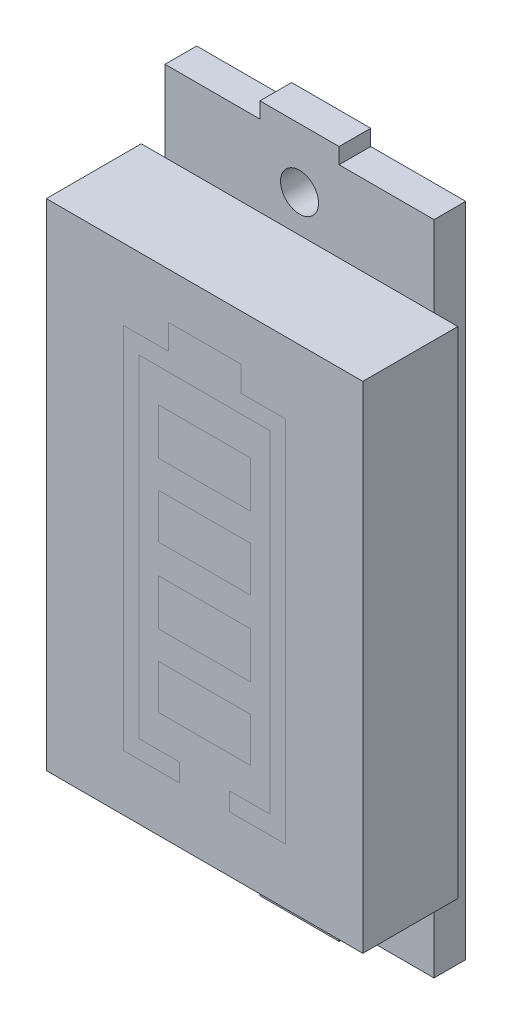
ISO-10303-21;
HEADER;
FILE_DESCRIPTION(('STEP AP214'),'2;1');
FILE_NAME('part.step','',(''),(''),'','','');
FILE_SCHEMA(('AUTOMOTIVE_DESIGN { 1 0 10303 214 1 1 1 1 }'));
ENDSEC;
DATA;
#1=APPLICATION_CONTEXT('core data for automotive mechanical design processes');
#2=APPLICATION_PROTOCOL_DEFINITION('international standard','automotive_design',2000,#1);
#3=PRODUCT_CONTEXT('',#1,'mechanical');
#4=PRODUCT('Part','Part','',(#3));
#5=PRODUCT_RELATED_PRODUCT_CATEGORY('part','',(#4));
#6=PRODUCT_DEFINITION_FORMATION('','',#4);
#7=PRODUCT_DEFINITION_CONTEXT('part definition',#1,'design');
#8=PRODUCT_DEFINITION('design','',#6,#7);
#9=PRODUCT_DEFINITION_SHAPE('','',#8);
#10=(LENGTH_UNIT() NAMED_UNIT(*) SI_UNIT(.MILLI.,.METRE.));
#11=(NAMED_UNIT(*) PLANE_ANGLE_UNIT() SI_UNIT($,.RADIAN.));
#12=(NAMED_UNIT(*) SI_UNIT($,.STERADIAN.) SOLID_ANGLE_UNIT());
#13=UNCERTAINTY_MEASURE_WITH_UNIT(LENGTH_MEASURE(1.E-05),#10,'distance_accuracy_value','');
#14=(GEOMETRIC_REPRESENTATION_CONTEXT(3) GLOBAL_UNCERTAINTY_ASSIGNED_CONTEXT((#13)) GLOBAL_UNIT_ASSIGNED_CONTEXT((#10,
#11,#12)) REPRESENTATION_CONTEXT('',''));
#15=CARTESIAN_POINT('',(0.,0.,0.));
#16=DIRECTION('',(0.,0.,1.));
#17=DIRECTION('',(1.,0.,0.));
#18=AXIS2_PLACEMENT_3D('',#15,#16,#17);
#19=CARTESIAN_POINT('',(0.,0.,6.));
#20=DIRECTION('',(0.,0.,-1.));
#21=DIRECTION('',(-1.,0.,0.));
#22=AXIS2_PLACEMENT_3D('',#19,#20,#21);
#23=PLANE('',#22);
#24=DIRECTION('',(0.,-1.,0.));
#25=VECTOR('',#24,1.);
#26=CARTESIAN_POINT('',(-2.9107326173968,0.,6.));
#27=LINE('',#26,#25);
#28=CARTESIAN_POINT('',(-2.9107326173968,3.2342308849601,6.));
#29=VERTEX_POINT('',#28);
#30=CARTESIAN_POINT('',(-2.9107326173968,0.401295867855901,6.));
#31=VERTEX_POINT('',#30);
#32=EDGE_CURVE('E475',#29,#31,#27,.T.);
#33=ORIENTED_EDGE('',*,*,#32,.F.);
#34=DIRECTION('',(-1.,0.,0.));
#35=VECTOR('',#34,1.);
#36=CARTESIAN_POINT('',(0.,3.2342308849601,6.));
#37=LINE('',#36,#35);
#38=CARTESIAN_POINT('',(2.9107326173968,3.2342308849601,6.));
#39=VERTEX_POINT('',#38);
#40=EDGE_CURVE('E465',#39,#29,#37,.T.);
#41=ORIENTED_EDGE('',*,*,#40,.F.);
#42=DIRECTION('',(0.,1.,0.));
#43=VECTOR('',#42,1.);
#44=CARTESIAN_POINT('',(2.9107326173968,0.,6.));
#45=LINE('',#44,#43);
#46=CARTESIAN_POINT('',(2.9107326173968,0.401295867855901,6.));
#47=VERTEX_POINT('',#46);
#48=EDGE_CURVE('E469',#47,#39,#45,.T.);
#49=ORIENTED_EDGE('',*,*,#48,.F.);
#50=DIRECTION('',(1.,0.,0.));
#51=VECTOR('',#50,1.);
#52=CARTESIAN_POINT('',(0.,0.401295867855901,6.));
#53=LINE('',#52,#51);
#54=EDGE_CURVE('E472',#31,#47,#53,.T.);
#55=ORIENTED_EDGE('',*,*,#54,.F.);
#56=EDGE_LOOP('',(#33,#41,#49,#55));
#57=FACE_BOUND('',#56,.T.);
#58=DIRECTION('',(0.,-1.,0.));
#59=VECTOR('',#58,1.);
#60=CARTESIAN_POINT('',(-2.9107326173968,0.,6.));
#61=LINE('',#60,#59);
#62=CARTESIAN_POINT('',(-2.9107326173968,-6.12532322244118,6.));
#63=VERTEX_POINT('',#62);
#64=CARTESIAN_POINT('',(-2.9107326173968,-8.92129561941144,6.));
#65=VERTEX_POINT('',#64);
#66=EDGE_CURVE('E449',#63,#65,#61,.T.);
#67=ORIENTED_EDGE('',*,*,#66,.F.);
#68=DIRECTION('',(-1.,0.,0.));
#69=VECTOR('',#68,1.);
#70=CARTESIAN_POINT('',(0.,-6.12532322244118,6.));
#71=LINE('',#70,#69);
#72=CARTESIAN_POINT('',(2.9107326173968,-6.12532322244118,6.));
#73=VERTEX_POINT('',#72);
#74=EDGE_CURVE('E439',#73,#63,#71,.T.);
#75=ORIENTED_EDGE('',*,*,#74,.F.);
#76=DIRECTION('',(0.,1.,0.));
#77=VECTOR('',#76,1.);
#78=CARTESIAN_POINT('',(2.9107326173968,0.,6.));
#79=LINE('',#78,#77);
#80=CARTESIAN_POINT('',(2.9107326173968,-8.92129561941144,6.));
#81=VERTEX_POINT('',#80);
#82=EDGE_CURVE('E443',#81,#73,#79,.T.);
#83=ORIENTED_EDGE('',*,*,#82,.F.);
#84=DIRECTION('',(1.,0.,0.));
#85=VECTOR('',#84,1.);
#86=CARTESIAN_POINT('',(0.,-8.92129561941144,6.));
#87=LINE('',#86,#85);
#88=EDGE_CURVE('E446',#65,#81,#87,.T.);
#89=ORIENTED_EDGE('',*,*,#88,.F.);
#90=EDGE_LOOP('',(#67,#75,#83,#89));
#91=FACE_BOUND('',#90,.T.);
#92=DIRECTION('',(0.,1.,0.));
#93=VECTOR('',#92,1.);
#94=CARTESIAN_POINT('',(10.,-15.65,6.));
#95=LINE('',#94,#93);
#96=CARTESIAN_POINT('',(10.,-15.65,6.));
#97=VERTEX_POINT('',#96);
#98=CARTESIAN_POINT('',(10.,15.65,6.));
#99=VERTEX_POINT('',#98);
#100=EDGE_CURVE('E355',#97,#99,#95,.T.);
#101=ORIENTED_EDGE('',*,*,#100,.T.);
#102=DIRECTION('',(-1.,0.,0.));
#103=VECTOR('',#102,1.);
#104=CARTESIAN_POINT('',(-10.,15.65,6.));
#105=LINE('',#104,#103);
#106=CARTESIAN_POINT('',(-10.,15.65,6.));
#107=VERTEX_POINT('',#106);
#108=EDGE_CURVE('E358',#99,#107,#105,.T.);
#109=ORIENTED_EDGE('',*,*,#108,.T.);
#110=DIRECTION('',(0.,-1.,0.));
#111=VECTOR('',#110,1.);
#112=CARTESIAN_POINT('',(-10.,-15.65,6.));
#113=LINE('',#112,#111);
#114=CARTESIAN_POINT('',(-10.,-15.65,6.));
#115=VERTEX_POINT('',#114);
#116=EDGE_CURVE('E361',#107,#115,#113,.T.);
#117=ORIENTED_EDGE('',*,*,#116,.T.);
#118=DIRECTION('',(1.,0.,0.));
#119=VECTOR('',#118,1.);
#120=CARTESIAN_POINT('',(-10.,-15.65,6.));
#121=LINE('',#120,#119);
#122=EDGE_CURVE('E363',#115,#97,#121,.T.);
#123=ORIENTED_EDGE('',*,*,#122,.T.);
#124=EDGE_LOOP('',(#101,#109,#117,#123));
#125=FACE_BOUND('',#124,.T.);
#126=DIRECTION('',(0.,1.,0.));
#127=VECTOR('',#126,1.);
#128=CARTESIAN_POINT('',(-1.58768687317069,0.,6.));
#129=LINE('',#128,#127);
#130=CARTESIAN_POINT('',(-1.58768687317069,-12.1184032650436,6.));
#131=VERTEX_POINT('',#130);
#132=CARTESIAN_POINT('',(-1.58768687317069,-10.972614646314,6.));
#133=VERTEX_POINT('',#132);
#134=EDGE_CURVE('E436',#131,#133,#129,.T.);
#135=ORIENTED_EDGE('',*,*,#134,.F.);
#136=DIRECTION('',(1.,0.,0.));
#137=VECTOR('',#136,1.);
#138=CARTESIAN_POINT('',(0.,-12.1184032650436,6.));
#139=LINE('',#138,#137);
#140=CARTESIAN_POINT('',(-5.11900421161258,-12.1184032650436,6.));
#141=VERTEX_POINT('',#140);
#142=EDGE_CURVE('E390',#141,#131,#139,.T.);
#143=ORIENTED_EDGE('',*,*,#142,.F.);
#144=DIRECTION('',(0.,-1.,0.));
#145=VECTOR('',#144,1.);
#146=CARTESIAN_POINT('',(-5.11900421161258,0.,6.));
#147=LINE('',#146,#145);
#148=CARTESIAN_POINT('',(-5.11900421161258,11.1491322110625,6.));
#149=VERTEX_POINT('',#148);
#150=EDGE_CURVE('E394',#149,#141,#147,.T.);
#151=ORIENTED_EDGE('',*,*,#150,.F.);
#152=DIRECTION('',(-1.,0.,0.));
#153=VECTOR('',#152,1.);
#154=CARTESIAN_POINT('',(0.,11.1491322110625,6.));
#155=LINE('',#154,#153);
#156=CARTESIAN_POINT('',(-2.29362193475144,11.1491322110625,6.));
#157=VERTEX_POINT('',#156);
#158=EDGE_CURVE('E397',#157,#149,#155,.T.);
#159=ORIENTED_EDGE('',*,*,#158,.F.);
#160=DIRECTION('',(0.,-1.,0.));
#161=VECTOR('',#160,1.);
#162=CARTESIAN_POINT('',(-2.29362193475144,0.,6.));
#163=LINE('',#162,#161);
#164=CARTESIAN_POINT('',(-2.29362193475144,12.7390471305929,6.));
#165=VERTEX_POINT('',#164);
#166=EDGE_CURVE('E400',#165,#157,#163,.T.);
#167=ORIENTED_EDGE('',*,*,#166,.F.);
#168=DIRECTION('',(-1.,0.,0.));
#169=VECTOR('',#168,1.);
#170=CARTESIAN_POINT('',(0.,12.7390471305929,6.));
#171=LINE('',#170,#169);
#172=CARTESIAN_POINT('',(2.29362193475143,12.7390471305929,6.));
#173=VERTEX_POINT('',#172);
#174=EDGE_CURVE('E403',#173,#165,#171,.T.);
#175=ORIENTED_EDGE('',*,*,#174,.F.);
#176=DIRECTION('',(0.,1.,0.));
#177=VECTOR('',#176,1.);
#178=CARTESIAN_POINT('',(2.29362193475143,0.,6.));
#179=LINE('',#178,#177);
#180=CARTESIAN_POINT('',(2.29362193475143,11.1491322110625,6.));
#181=VERTEX_POINT('',#180);
#182=EDGE_CURVE('E406',#181,#173,#179,.T.);
#183=ORIENTED_EDGE('',*,*,#182,.F.);
#184=DIRECTION('',(-1.,0.,0.));
#185=VECTOR('',#184,1.);
#186=CARTESIAN_POINT('',(0.,11.1491322110625,6.));
#187=LINE('',#186,#185);
#188=CARTESIAN_POINT('',(5.11900421161257,11.1491322110625,6.));
#189=VERTEX_POINT('',#188);
#190=EDGE_CURVE('E409',#189,#181,#187,.T.);
#191=ORIENTED_EDGE('',*,*,#190,.F.);
#192=DIRECTION('',(0.,1.,0.));
#193=VECTOR('',#192,1.);
#194=CARTESIAN_POINT('',(5.11900421161257,0.,6.));
#195=LINE('',#194,#193);
#196=CARTESIAN_POINT('',(5.11900421161257,-12.1184032650436,6.));
#197=VERTEX_POINT('',#196);
#198=EDGE_CURVE('E412',#197,#189,#195,.T.);
#199=ORIENTED_EDGE('',*,*,#198,.F.);
#200=DIRECTION('',(1.,0.,0.));
#201=VECTOR('',#200,1.);
#202=CARTESIAN_POINT('',(0.,-12.1184032650436,6.));
#203=LINE('',#202,#201);
#204=CARTESIAN_POINT('',(1.58768687317069,-12.1184032650436,6.));
#205=VERTEX_POINT('',#204);
#206=EDGE_CURVE('E415',#205,#197,#203,.T.);
#207=ORIENTED_EDGE('',*,*,#206,.F.);
#208=DIRECTION('',(0.,-1.,0.));
#209=VECTOR('',#208,1.);
#210=CARTESIAN_POINT('',(1.58768687317069,0.,6.));
#211=LINE('',#210,#209);
#212=CARTESIAN_POINT('',(1.58768687317069,-10.972614646314,6.));
#213=VERTEX_POINT('',#212);
#214=EDGE_CURVE('E418',#213,#205,#211,.T.);
#215=ORIENTED_EDGE('',*,*,#214,.F.);
#216=DIRECTION('',(-1.,0.,0.));
#217=VECTOR('',#216,1.);
#218=CARTESIAN_POINT('',(0.,-10.972614646314,6.));
#219=LINE('',#218,#217);
#220=CARTESIAN_POINT('',(4.12847373491433,-10.972614646314,6.));
#221=VERTEX_POINT('',#220);
#222=EDGE_CURVE('E421',#221,#213,#219,.T.);
#223=ORIENTED_EDGE('',*,*,#222,.F.);
#224=DIRECTION('',(0.,-1.,0.));
#225=VECTOR('',#224,1.);
#226=CARTESIAN_POINT('',(4.12847373491433,0.,6.));
#227=LINE('',#226,#225);
#228=CARTESIAN_POINT('',(4.12847373491433,10.0169154362936,6.));
#229=VERTEX_POINT('',#228);
#230=EDGE_CURVE('E424',#229,#221,#227,.T.);
#231=ORIENTED_EDGE('',*,*,#230,.F.);
#232=DIRECTION('',(1.,0.,0.));
#233=VECTOR('',#232,1.);
#234=CARTESIAN_POINT('',(0.,10.0169154362936,6.));
#235=LINE('',#234,#233);
#236=CARTESIAN_POINT('',(-4.12847373491433,10.0169154362936,6.));
#237=VERTEX_POINT('',#236);
#238=EDGE_CURVE('E427',#237,#229,#235,.T.);
#239=ORIENTED_EDGE('',*,*,#238,.F.);
#240=DIRECTION('',(0.,1.,0.));
#241=VECTOR('',#240,1.);
#242=CARTESIAN_POINT('',(-4.12847373491433,0.,6.));
#243=LINE('',#242,#241);
#244=CARTESIAN_POINT('',(-4.12847373491433,-10.972614646314,6.));
#245=VERTEX_POINT('',#244);
#246=EDGE_CURVE('E430',#245,#237,#243,.T.);
#247=ORIENTED_EDGE('',*,*,#246,.F.);
#248=DIRECTION('',(-1.,0.,0.));
#249=VECTOR('',#248,1.);
#250=CARTESIAN_POINT('',(0.,-10.972614646314,6.));
#251=LINE('',#250,#249);
#252=EDGE_CURVE('E433',#133,#245,#251,.T.);
#253=ORIENTED_EDGE('',*,*,#252,.F.);
#254=EDGE_LOOP('',(#135,#143,#151,#159,#167,#175,#183,#191,#199,#207,#215,#223,#231,#239,#247,#253));
#255=FACE_BOUND('',#254,.T.);
#256=DIRECTION('',(0.,-1.,0.));
#257=VECTOR('',#256,1.);
#258=CARTESIAN_POINT('',(-2.9107326173968,0.,6.));
#259=LINE('',#258,#257);
#260=CARTESIAN_POINT('',(-2.9107326173968,-1.44093348775742,6.));
#261=VERTEX_POINT('',#260);
#262=CARTESIAN_POINT('',(-2.9107326173968,-4.35016215370794,6.));
#263=VERTEX_POINT('',#262);
#264=EDGE_CURVE('E462',#261,#263,#259,.T.);
#265=ORIENTED_EDGE('',*,*,#264,.F.);
#266=DIRECTION('',(-1.,0.,0.));
#267=VECTOR('',#266,1.);
#268=CARTESIAN_POINT('',(0.,-1.44093348775742,6.));
#269=LINE('',#268,#267);
#270=CARTESIAN_POINT('',(2.9107326173968,-1.44093348775742,6.));
#271=VERTEX_POINT('',#270);
#272=EDGE_CURVE('E452',#271,#261,#269,.T.);
#273=ORIENTED_EDGE('',*,*,#272,.F.);
#274=DIRECTION('',(0.,1.,0.));
#275=VECTOR('',#274,1.);
#276=CARTESIAN_POINT('',(2.9107326173968,0.,6.));
#277=LINE('',#276,#275);
#278=CARTESIAN_POINT('',(2.9107326173968,-4.35016215370794,6.));
#279=VERTEX_POINT('',#278);
#280=EDGE_CURVE('E456',#279,#271,#277,.T.);
#281=ORIENTED_EDGE('',*,*,#280,.F.);
#282=DIRECTION('',(1.,0.,0.));
#283=VECTOR('',#282,1.);
#284=CARTESIAN_POINT('',(0.,-4.35016215370794,6.));
#285=LINE('',#284,#283);
#286=EDGE_CURVE('E459',#263,#279,#285,.T.);
#287=ORIENTED_EDGE('',*,*,#286,.F.);
#288=EDGE_LOOP('',(#265,#273,#281,#287));
#289=FACE_BOUND('',#288,.T.);
#290=DIRECTION('',(0.,-1.,0.));
#291=VECTOR('',#290,1.);
#292=CARTESIAN_POINT('',(-2.9107326173968,0.,6.));
#293=LINE('',#292,#291);
#294=CARTESIAN_POINT('',(-2.9107326173968,7.90670349185868,6.));
#295=VERTEX_POINT('',#294);
#296=CARTESIAN_POINT('',(-2.9107326173968,4.99048017288609,6.));
#297=VERTEX_POINT('',#296);
#298=EDGE_CURVE('E11',#295,#297,#293,.T.);
#299=ORIENTED_EDGE('',*,*,#298,.F.);
#300=DIRECTION('',(-1.,0.,0.));
#301=VECTOR('',#300,1.);
#302=CARTESIAN_POINT('',(0.,7.90670349185868,6.));
#303=LINE('',#302,#301);
#304=CARTESIAN_POINT('',(2.9107326173968,7.90670349185868,6.));
#305=VERTEX_POINT('',#304);
#306=EDGE_CURVE('E478',#305,#295,#303,.T.);
#307=ORIENTED_EDGE('',*,*,#306,.F.);
#308=DIRECTION('',(0.,1.,0.));
#309=VECTOR('',#308,1.);
#310=CARTESIAN_POINT('',(2.9107326173968,0.,6.));
#311=LINE('',#310,#309);
#312=CARTESIAN_POINT('',(2.9107326173968,4.99048017288609,6.));
#313=VERTEX_POINT('',#312);
#314=EDGE_CURVE('E481',#313,#305,#311,.T.);
#315=ORIENTED_EDGE('',*,*,#314,.F.);
#316=DIRECTION('',(1.,0.,0.));
#317=VECTOR('',#316,1.);
#318=CARTESIAN_POINT('',(0.,4.99048017288609,6.));
#319=LINE('',#318,#317);
#320=EDGE_CURVE('E45',#297,#313,#319,.T.);
#321=ORIENTED_EDGE('',*,*,#320,.F.);
#322=EDGE_LOOP('',(#299,#307,#315,#321));
#323=FACE_BOUND('',#322,.T.);
#324=ADVANCED_FACE('F36',(#57,#91,#125,#255,#289,#323),#23,.F.);
#325=ORIENTED_EDGE('',*,*,#306,.T.);
#326=ORIENTED_EDGE('',*,*,#298,.T.);
#327=ORIENTED_EDGE('',*,*,#320,.T.);
#328=ORIENTED_EDGE('',*,*,#314,.T.);
#329=EDGE_LOOP('',(#325,#326,#327,#328));
#330=FACE_BOUND('',#329,.T.);
#331=ADVANCED_FACE('F549',(#330),#23,.F.);
#332=ORIENTED_EDGE('',*,*,#40,.T.);
#333=ORIENTED_EDGE('',*,*,#32,.T.);
#334=ORIENTED_EDGE('',*,*,#54,.T.);
#335=ORIENTED_EDGE('',*,*,#48,.T.);
#336=EDGE_LOOP('',(#332,#333,#334,#335));
#337=FACE_BOUND('',#336,.T.);
#338=ADVANCED_FACE('F558',(#337),#23,.F.);
#339=ORIENTED_EDGE('',*,*,#272,.T.);
#340=ORIENTED_EDGE('',*,*,#264,.T.);
#341=ORIENTED_EDGE('',*,*,#286,.T.);
#342=ORIENTED_EDGE('',*,*,#280,.T.);
#343=EDGE_LOOP('',(#339,#340,#341,#342));
#344=FACE_BOUND('',#343,.T.);
#345=ADVANCED_FACE('F579',(#344),#23,.F.);
#346=ORIENTED_EDGE('',*,*,#74,.T.);
#347=ORIENTED_EDGE('',*,*,#66,.T.);
#348=ORIENTED_EDGE('',*,*,#88,.T.);
#349=ORIENTED_EDGE('',*,*,#82,.T.);
#350=EDGE_LOOP('',(#346,#347,#348,#349));
#351=FACE_BOUND('',#350,.T.);
#352=ADVANCED_FACE('F566',(#351),#23,.F.);
#353=CARTESIAN_POINT('',(0.,0.,-2.));
#354=DIRECTION('',(0.,0.,1.));
#355=DIRECTION('',(1.,0.,0.));
#356=AXIS2_PLACEMENT_3D('',#353,#354,#355);
#357=PLANE('',#356);
#358=CARTESIAN_POINT('',(0.,-18.,-2.));
#359=DIRECTION('',(0.,0.,-1.));
#360=DIRECTION('',(-1.,0.,0.));
#361=AXIS2_PLACEMENT_3D('',#358,#359,#360);
#362=CIRCLE('',#361,1.2);
#363=CARTESIAN_POINT('',(-1.2,-18.,-2.));
#364=VERTEX_POINT('',#363);
#365=EDGE_CURVE('E704',#364,#364,#362,.T.);
#366=ORIENTED_EDGE('',*,*,#365,.F.);
#367=EDGE_LOOP('',(#366));
#368=FACE_BOUND('',#367,.T.);
#369=DIRECTION('',(-1.,0.,0.));
#370=VECTOR('',#369,1.);
#371=CARTESIAN_POINT('',(8.5,-20.75,-2.));
#372=LINE('',#371,#370);
#373=CARTESIAN_POINT('',(8.5,-20.75,-2.));
#374=VERTEX_POINT('',#373);
#375=CARTESIAN_POINT('',(2.5,-20.75,-2.));
#376=VERTEX_POINT('',#375);
#377=EDGE_CURVE('E324',#374,#376,#372,.T.);
#378=ORIENTED_EDGE('',*,*,#377,.T.);
#379=DIRECTION('',(0.,-1.,0.));
#380=VECTOR('',#379,1.);
#381=CARTESIAN_POINT('',(2.5,-21.75,-2.));
#382=LINE('',#381,#380);
#383=CARTESIAN_POINT('',(2.5,-21.75,-2.));
#384=VERTEX_POINT('',#383);
#385=EDGE_CURVE('E291',#376,#384,#382,.T.);
#386=ORIENTED_EDGE('',*,*,#385,.T.);
#387=DIRECTION('',(-1.,0.,0.));
#388=VECTOR('',#387,1.);
#389=CARTESIAN_POINT('',(2.5,-21.75,-2.));
#390=LINE('',#389,#388);
#391=CARTESIAN_POINT('',(-2.5,-21.75,-2.));
#392=VERTEX_POINT('',#391);
#393=EDGE_CURVE('E265',#384,#392,#390,.T.);
#394=ORIENTED_EDGE('',*,*,#393,.T.);
#395=DIRECTION('',(0.,1.,0.));
#396=VECTOR('',#395,1.);
#397=CARTESIAN_POINT('',(-2.5,-21.75,-2.));
#398=LINE('',#397,#396);
#399=CARTESIAN_POINT('',(-2.5,-20.75,-2.));
#400=VERTEX_POINT('',#399);
#401=EDGE_CURVE('E287',#392,#400,#398,.T.);
#402=ORIENTED_EDGE('',*,*,#401,.T.);
#403=CARTESIAN_POINT('',(-8.5,-20.75,-2.));
#404=VERTEX_POINT('',#403);
#405=EDGE_CURVE('E323',#400,#404,#372,.T.);
#406=ORIENTED_EDGE('',*,*,#405,.T.);
#407=DIRECTION('',(0.,1.,0.));
#408=VECTOR('',#407,1.);
#409=CARTESIAN_POINT('',(-8.5,-20.75,-2.));
#410=LINE('',#409,#408);
#411=CARTESIAN_POINT('',(-8.5,20.75,-2.));
#412=VERTEX_POINT('',#411);
#413=EDGE_CURVE('E313',#404,#412,#410,.T.);
#414=ORIENTED_EDGE('',*,*,#413,.T.);
#415=DIRECTION('',(1.,0.,0.));
#416=VECTOR('',#415,1.);
#417=CARTESIAN_POINT('',(8.5,20.75,-2.));
#418=LINE('',#417,#416);
#419=CARTESIAN_POINT('',(-2.5,20.75,-2.));
#420=VERTEX_POINT('',#419);
#421=EDGE_CURVE('E318',#412,#420,#418,.T.);
#422=ORIENTED_EDGE('',*,*,#421,.T.);
#423=CARTESIAN_POINT('',(-2.5,21.75,-2.));
#424=VERTEX_POINT('',#423);
#425=EDGE_CURVE('E289',#420,#424,#398,.T.);
#426=ORIENTED_EDGE('',*,*,#425,.T.);
#427=DIRECTION('',(1.,0.,0.));
#428=VECTOR('',#427,1.);
#429=CARTESIAN_POINT('',(2.5,21.75,-2.));
#430=LINE('',#429,#428);
#431=CARTESIAN_POINT('',(2.5,21.75,-2.));
#432=VERTEX_POINT('',#431);
#433=EDGE_CURVE('E272',#424,#432,#430,.T.);
#434=ORIENTED_EDGE('',*,*,#433,.T.);
#435=CARTESIAN_POINT('',(2.5,20.75,-2.));
#436=VERTEX_POINT('',#435);
#437=EDGE_CURVE('E292',#432,#436,#382,.T.);
#438=ORIENTED_EDGE('',*,*,#437,.T.);
#439=CARTESIAN_POINT('',(8.5,20.75,-2.));
#440=VERTEX_POINT('',#439);
#441=EDGE_CURVE('E316',#436,#440,#418,.T.);
#442=ORIENTED_EDGE('',*,*,#441,.T.);
#443=DIRECTION('',(0.,-1.,0.));
#444=VECTOR('',#443,1.);
#445=CARTESIAN_POINT('',(8.5,-20.75,-2.));
#446=LINE('',#445,#444);
#447=EDGE_CURVE('E321',#440,#374,#446,.T.);
#448=ORIENTED_EDGE('',*,*,#447,.T.);
#449=EDGE_LOOP('',(#378,#386,#394,#402,#406,#414,#422,#426,#434,#438,#442,#448));
#450=FACE_BOUND('',#449,.T.);
#451=CARTESIAN_POINT('',(0.,18.,-2.));
#452=DIRECTION('',(0.,0.,-1.));
#453=DIRECTION('',(-1.,0.,0.));
#454=AXIS2_PLACEMENT_3D('',#451,#452,#453);
#455=CIRCLE('',#454,1.2);
#456=CARTESIAN_POINT('',(-1.19999999999999,18.,-2.));
#457=VERTEX_POINT('',#456);
#458=EDGE_CURVE('E705',#457,#457,#455,.T.);
#459=ORIENTED_EDGE('',*,*,#458,.F.);
#460=EDGE_LOOP('',(#459));
#461=FACE_BOUND('',#460,.T.);
#462=ADVANCED_FACE('F578',(#368,#450,#461),#357,.F.);
#463=CARTESIAN_POINT('',(8.5,20.75,-2.));
#464=DIRECTION('',(0.,-1.,0.));
#465=DIRECTION('',(0.,0.,-1.));
#466=AXIS2_PLACEMENT_3D('',#463,#464,#465);
#467=PLANE('',#466);
#468=DIRECTION('',(1.,0.,0.));
#469=VECTOR('',#468,1.);
#470=CARTESIAN_POINT('',(8.5,20.75,0.));
#471=LINE('',#470,#469);
#472=CARTESIAN_POINT('',(-8.5,20.75,0.));
#473=VERTEX_POINT('',#472);
#474=CARTESIAN_POINT('',(-2.5,20.75,0.));
#475=VERTEX_POINT('',#474);
#476=EDGE_CURVE('E333',#473,#475,#471,.T.);
#477=ORIENTED_EDGE('',*,*,#476,.T.);
#478=DIRECTION('',(0.,0.,-1.));
#479=VECTOR('',#478,1.);
#480=CARTESIAN_POINT('',(-2.5,20.75,-2.));
#481=LINE('',#480,#479);
#482=EDGE_CURVE('E259',#475,#420,#481,.T.);
#483=ORIENTED_EDGE('',*,*,#482,.T.);
#484=ORIENTED_EDGE('',*,*,#421,.F.);
#485=DIRECTION('',(0.,0.,1.));
#486=VECTOR('',#485,1.);
#487=CARTESIAN_POINT('',(-8.5,20.75,-2.));
#488=LINE('',#487,#486);
#489=EDGE_CURVE('E351',#412,#473,#488,.T.);
#490=ORIENTED_EDGE('',*,*,#489,.T.);
#491=EDGE_LOOP('',(#477,#483,#484,#490));
#492=FACE_BOUND('',#491,.T.);
#493=ADVANCED_FACE('F585',(#492),#467,.F.);
#494=CARTESIAN_POINT('',(8.5,-20.75,-2.));
#495=DIRECTION('',(0.,1.,0.));
#496=DIRECTION('',(0.,0.,1.));
#497=AXIS2_PLACEMENT_3D('',#494,#495,#496);
#498=PLANE('',#497);
#499=ORIENTED_EDGE('',*,*,#405,.F.);
#500=DIRECTION('',(0.,0.,1.));
#501=VECTOR('',#500,1.);
#502=CARTESIAN_POINT('',(-2.5,-20.75,-2.));
#503=LINE('',#502,#501);
#504=CARTESIAN_POINT('',(-2.5,-20.75,0.));
#505=VERTEX_POINT('',#504);
#506=EDGE_CURVE('E308',#400,#505,#503,.T.);
#507=ORIENTED_EDGE('',*,*,#506,.T.);
#508=DIRECTION('',(-1.,0.,0.));
#509=VECTOR('',#508,1.);
#510=CARTESIAN_POINT('',(8.5,-20.75,0.));
#511=LINE('',#510,#509);
#512=CARTESIAN_POINT('',(-8.5,-20.75,0.));
#513=VERTEX_POINT('',#512);
#514=EDGE_CURVE('E339',#505,#513,#511,.T.);
#515=ORIENTED_EDGE('',*,*,#514,.T.);
#516=DIRECTION('',(0.,0.,1.));
#517=VECTOR('',#516,1.);
#518=CARTESIAN_POINT('',(-8.5,-20.75,-2.));
#519=LINE('',#518,#517);
#520=EDGE_CURVE('E327',#404,#513,#519,.T.);
#521=ORIENTED_EDGE('',*,*,#520,.F.);
#522=EDGE_LOOP('',(#499,#507,#515,#521));
#523=FACE_BOUND('',#522,.T.);
#524=ADVANCED_FACE('F671',(#523),#498,.F.);
#525=CARTESIAN_POINT('',(0.,0.,0.));
#526=DIRECTION('',(0.,0.,-1.));
#527=DIRECTION('',(-1.,0.,0.));
#528=AXIS2_PLACEMENT_3D('',#525,#526,#527);
#529=PLANE('',#528);
#530=DIRECTION('',(0.,1.,0.));
#531=VECTOR('',#530,1.);
#532=CARTESIAN_POINT('',(-8.5,-20.75,0.));
#533=LINE('',#532,#531);
#534=CARTESIAN_POINT('',(-8.5,-15.65,0.));
#535=VERTEX_POINT('',#534);
#536=CARTESIAN_POINT('',(-8.5,15.65,0.));
#537=VERTEX_POINT('',#536);
#538=EDGE_CURVE('E332',#535,#537,#533,.T.);
#539=ORIENTED_EDGE('',*,*,#538,.F.);
#540=DIRECTION('',(1.,0.,0.));
#541=VECTOR('',#540,1.);
#542=CARTESIAN_POINT('',(-10.,-15.65,0.));
#543=LINE('',#542,#541);
#544=CARTESIAN_POINT('',(-10.,-15.65,0.));
#545=VERTEX_POINT('',#544);
#546=EDGE_CURVE('E359',#545,#535,#543,.T.);
#547=ORIENTED_EDGE('',*,*,#546,.F.);
#548=DIRECTION('',(0.,-1.,0.));
#549=VECTOR('',#548,1.);
#550=CARTESIAN_POINT('',(-10.,-15.65,0.));
#551=LINE('',#550,#549);
#552=CARTESIAN_POINT('',(-10.,15.65,0.));
#553=VERTEX_POINT('',#552);
#554=EDGE_CURVE('E372',#553,#545,#551,.T.);
#555=ORIENTED_EDGE('',*,*,#554,.F.);
#556=DIRECTION('',(-1.,0.,0.));
#557=VECTOR('',#556,1.);
#558=CARTESIAN_POINT('',(-10.,15.65,0.));
#559=LINE('',#558,#557);
#560=EDGE_CURVE('E368',#537,#553,#559,.T.);
#561=ORIENTED_EDGE('',*,*,#560,.F.);
#562=EDGE_LOOP('',(#539,#547,#555,#561));
#563=FACE_BOUND('',#562,.T.);
#564=ADVANCED_FACE('F573',(#563),#529,.T.);
#565=CARTESIAN_POINT('',(10.,-15.65,6.));
#566=DIRECTION('',(-1.,0.,0.));
#567=DIRECTION('',(0.,0.,1.));
#568=AXIS2_PLACEMENT_3D('',#565,#566,#567);
#569=PLANE('',#568);
#570=DIRECTION('',(0.,1.,0.));
#571=VECTOR('',#570,1.);
#572=CARTESIAN_POINT('',(10.,-15.65,0.));
#573=LINE('',#572,#571);
#574=CARTESIAN_POINT('',(10.,-15.65,0.));
#575=VERTEX_POINT('',#574);
#576=CARTESIAN_POINT('',(10.,15.65,0.));
#577=VERTEX_POINT('',#576);
#578=EDGE_CURVE('E354',#575,#577,#573,.T.);
#579=ORIENTED_EDGE('',*,*,#578,.T.);
#580=DIRECTION('',(0.,0.,-1.));
#581=VECTOR('',#580,1.);
#582=CARTESIAN_POINT('',(10.,15.65,6.));
#583=LINE('',#582,#581);
#584=EDGE_CURVE('E387',#99,#577,#583,.T.);
#585=ORIENTED_EDGE('',*,*,#584,.F.);
#586=ORIENTED_EDGE('',*,*,#100,.F.);
#587=DIRECTION('',(0.,0.,-1.));
#588=VECTOR('',#587,1.);
#589=CARTESIAN_POINT('',(10.,-15.65,6.));
#590=LINE('',#589,#588);
#591=EDGE_CURVE('E365',#97,#575,#590,.T.);
#592=ORIENTED_EDGE('',*,*,#591,.T.);
#593=EDGE_LOOP('',(#579,#585,#586,#592));
#594=FACE_BOUND('',#593,.T.);
#595=ADVANCED_FACE('F38',(#594),#569,.F.);
#596=CARTESIAN_POINT('',(-10.,15.65,6.));
#597=DIRECTION('',(0.,-1.,0.));
#598=DIRECTION('',(0.,0.,-1.));
#599=AXIS2_PLACEMENT_3D('',#596,#597,#598);
#600=PLANE('',#599);
#601=CARTESIAN_POINT('',(8.5,15.65,0.));
#602=VERTEX_POINT('',#601);
#603=EDGE_CURVE('E369',#577,#602,#559,.T.);
#604=ORIENTED_EDGE('',*,*,#603,.T.);
#605=EDGE_CURVE('E373',#602,#537,#559,.T.);
#606=ORIENTED_EDGE('',*,*,#605,.T.);
#607=ORIENTED_EDGE('',*,*,#560,.T.);
#608=DIRECTION('',(0.,0.,-1.));
#609=VECTOR('',#608,1.);
#610=CARTESIAN_POINT('',(-10.,15.65,6.));
#611=LINE('',#610,#609);
#612=EDGE_CURVE('E384',#107,#553,#611,.T.);
#613=ORIENTED_EDGE('',*,*,#612,.F.);
#614=ORIENTED_EDGE('',*,*,#108,.F.);
#615=ORIENTED_EDGE('',*,*,#584,.T.);
#616=EDGE_LOOP('',(#604,#606,#607,#613,#614,#615));
#617=FACE_BOUND('',#616,.T.);
#618=ADVANCED_FACE('F621',(#617),#600,.F.);
#619=CARTESIAN_POINT('',(-10.,-15.65,6.));
#620=DIRECTION('',(1.,0.,0.));
#621=DIRECTION('',(0.,0.,-1.));
#622=AXIS2_PLACEMENT_3D('',#619,#620,#621);
#623=PLANE('',#622);
#624=ORIENTED_EDGE('',*,*,#554,.T.);
#625=DIRECTION('',(0.,0.,-1.));
#626=VECTOR('',#625,1.);
#627=CARTESIAN_POINT('',(-10.,-15.65,6.));
#628=LINE('',#627,#626);
#629=EDGE_CURVE('E381',#115,#545,#628,.T.);
#630=ORIENTED_EDGE('',*,*,#629,.F.);
#631=ORIENTED_EDGE('',*,*,#116,.F.);
#632=ORIENTED_EDGE('',*,*,#612,.T.);
#633=EDGE_LOOP('',(#624,#630,#631,#632));
#634=FACE_BOUND('',#633,.T.);
#635=ADVANCED_FACE('F574',(#634),#623,.F.);
#636=CARTESIAN_POINT('',(-10.,-15.65,6.));
#637=DIRECTION('',(0.,1.,0.));
#638=DIRECTION('',(0.,0.,1.));
#639=AXIS2_PLACEMENT_3D('',#636,#637,#638);
#640=PLANE('',#639);
#641=ORIENTED_EDGE('',*,*,#546,.T.);
#642=CARTESIAN_POINT('',(8.5,-15.65,0.));
#643=VERTEX_POINT('',#642);
#644=EDGE_CURVE('E378',#535,#643,#543,.T.);
#645=ORIENTED_EDGE('',*,*,#644,.T.);
#646=EDGE_CURVE('E375',#643,#575,#543,.T.);
#647=ORIENTED_EDGE('',*,*,#646,.T.);
#648=ORIENTED_EDGE('',*,*,#591,.F.);
#649=ORIENTED_EDGE('',*,*,#122,.F.);
#650=ORIENTED_EDGE('',*,*,#629,.T.);
#651=EDGE_LOOP('',(#641,#645,#647,#648,#649,#650));
#652=FACE_BOUND('',#651,.T.);
#653=ADVANCED_FACE('F564',(#652),#640,.F.);
#654=ORIENTED_EDGE('',*,*,#142,.T.);
#655=ORIENTED_EDGE('',*,*,#134,.T.);
#656=ORIENTED_EDGE('',*,*,#252,.T.);
#657=ORIENTED_EDGE('',*,*,#246,.T.);
#658=ORIENTED_EDGE('',*,*,#238,.T.);
#659=ORIENTED_EDGE('',*,*,#230,.T.);
#660=ORIENTED_EDGE('',*,*,#222,.T.);
#661=ORIENTED_EDGE('',*,*,#214,.T.);
#662=ORIENTED_EDGE('',*,*,#206,.T.);
#663=ORIENTED_EDGE('',*,*,#198,.T.);
#664=ORIENTED_EDGE('',*,*,#190,.T.);
#665=ORIENTED_EDGE('',*,*,#182,.T.);
#666=ORIENTED_EDGE('',*,*,#174,.T.);
#667=ORIENTED_EDGE('',*,*,#166,.T.);
#668=ORIENTED_EDGE('',*,*,#158,.T.);
#669=ORIENTED_EDGE('',*,*,#150,.T.);
#670=EDGE_LOOP('',(#654,#655,#656,#657,#658,#659,#660,#661,#662,#663,#664,#665,#666,#667,#668,#669));
#671=FACE_BOUND('',#670,.T.);
#672=ADVANCED_FACE('F554',(#671),#23,.F.);
#673=DIRECTION('',(0.,-1.,0.));
#674=VECTOR('',#673,1.);
#675=CARTESIAN_POINT('',(8.5,-20.75,0.));
#676=LINE('',#675,#674);
#677=EDGE_CURVE('E340',#602,#643,#676,.T.);
#678=ORIENTED_EDGE('',*,*,#677,.F.);
#679=ORIENTED_EDGE('',*,*,#603,.F.);
#680=ORIENTED_EDGE('',*,*,#578,.F.);
#681=ORIENTED_EDGE('',*,*,#646,.F.);
#682=EDGE_LOOP('',(#678,#679,#680,#681));
#683=FACE_BOUND('',#682,.T.);
#684=ADVANCED_FACE('F563',(#683),#529,.T.);
#685=CARTESIAN_POINT('',(0.,0.,0.));
#686=DIRECTION('',(0.,0.,1.));
#687=DIRECTION('',(1.,0.,0.));
#688=AXIS2_PLACEMENT_3D('',#685,#686,#687);
#689=PLANE('',#688);
#690=CARTESIAN_POINT('',(0.,-18.,0.));
#691=DIRECTION('',(0.,0.,1.));
#692=DIRECTION('',(1.,0.,0.));
#693=AXIS2_PLACEMENT_3D('',#690,#691,#692);
#694=CIRCLE('',#693,1.2);
#695=CARTESIAN_POINT('',(1.2,-18.,0.));
#696=VERTEX_POINT('',#695);
#697=EDGE_CURVE('E708',#696,#696,#694,.T.);
#698=ORIENTED_EDGE('',*,*,#697,.F.);
#699=EDGE_LOOP('',(#698));
#700=FACE_BOUND('',#699,.T.);
#701=CARTESIAN_POINT('',(8.5,-20.75,0.));
#702=VERTEX_POINT('',#701);
#703=EDGE_CURVE('E335',#643,#702,#676,.T.);
#704=ORIENTED_EDGE('',*,*,#703,.F.);
#705=ORIENTED_EDGE('',*,*,#644,.F.);
#706=EDGE_CURVE('E328',#513,#535,#533,.T.);
#707=ORIENTED_EDGE('',*,*,#706,.F.);
#708=ORIENTED_EDGE('',*,*,#514,.F.);
#709=DIRECTION('',(0.,1.,0.));
#710=VECTOR('',#709,1.);
#711=CARTESIAN_POINT('',(-2.5,-21.75,0.));
#712=LINE('',#711,#710);
#713=CARTESIAN_POINT('',(-2.5,-21.75,0.));
#714=VERTEX_POINT('',#713);
#715=EDGE_CURVE('E264',#714,#505,#712,.T.);
#716=ORIENTED_EDGE('',*,*,#715,.F.);
#717=DIRECTION('',(-1.,0.,0.));
#718=VECTOR('',#717,1.);
#719=CARTESIAN_POINT('',(2.5,-21.75,0.));
#720=LINE('',#719,#718);
#721=CARTESIAN_POINT('',(2.5,-21.75,0.));
#722=VERTEX_POINT('',#721);
#723=EDGE_CURVE('E274',#722,#714,#720,.T.);
#724=ORIENTED_EDGE('',*,*,#723,.F.);
#725=DIRECTION('',(0.,-1.,0.));
#726=VECTOR('',#725,1.);
#727=CARTESIAN_POINT('',(2.5,-21.75,0.));
#728=LINE('',#727,#726);
#729=CARTESIAN_POINT('',(2.5,-20.75,0.));
#730=VERTEX_POINT('',#729);
#731=EDGE_CURVE('E280',#730,#722,#728,.T.);
#732=ORIENTED_EDGE('',*,*,#731,.F.);
#733=EDGE_CURVE('E317',#702,#730,#511,.T.);
#734=ORIENTED_EDGE('',*,*,#733,.F.);
#735=EDGE_LOOP('',(#704,#705,#707,#708,#716,#724,#732,#734));
#736=FACE_BOUND('',#735,.T.);
#737=ADVANCED_FACE('F571',(#700,#736),#689,.T.);
#738=CARTESIAN_POINT('',(0.,18.,0.));
#739=DIRECTION('',(0.,0.,1.));
#740=DIRECTION('',(1.,0.,0.));
#741=AXIS2_PLACEMENT_3D('',#738,#739,#740);
#742=CIRCLE('',#741,1.2);
#743=CARTESIAN_POINT('',(1.20000000000001,18.,0.));
#744=VERTEX_POINT('',#743);
#745=EDGE_CURVE('E702',#744,#744,#742,.T.);
#746=ORIENTED_EDGE('',*,*,#745,.F.);
#747=EDGE_LOOP('',(#746));
#748=FACE_BOUND('',#747,.T.);
#749=CARTESIAN_POINT('',(2.5,20.75,0.));
#750=VERTEX_POINT('',#749);
#751=CARTESIAN_POINT('',(8.5,20.75,0.));
#752=VERTEX_POINT('',#751);
#753=EDGE_CURVE('E331',#750,#752,#471,.T.);
#754=ORIENTED_EDGE('',*,*,#753,.F.);
#755=CARTESIAN_POINT('',(2.5,21.75,0.));
#756=VERTEX_POINT('',#755);
#757=EDGE_CURVE('E279',#756,#750,#728,.T.);
#758=ORIENTED_EDGE('',*,*,#757,.F.);
#759=DIRECTION('',(1.,0.,0.));
#760=VECTOR('',#759,1.);
#761=CARTESIAN_POINT('',(2.5,21.75,0.));
#762=LINE('',#761,#760);
#763=CARTESIAN_POINT('',(-2.5,21.75,0.));
#764=VERTEX_POINT('',#763);
#765=EDGE_CURVE('E270',#764,#756,#762,.T.);
#766=ORIENTED_EDGE('',*,*,#765,.F.);
#767=EDGE_CURVE('E253',#475,#764,#712,.T.);
#768=ORIENTED_EDGE('',*,*,#767,.F.);
#769=ORIENTED_EDGE('',*,*,#476,.F.);
#770=EDGE_CURVE('E312',#537,#473,#533,.T.);
#771=ORIENTED_EDGE('',*,*,#770,.F.);
#772=ORIENTED_EDGE('',*,*,#605,.F.);
#773=EDGE_CURVE('E336',#752,#602,#676,.T.);
#774=ORIENTED_EDGE('',*,*,#773,.F.);
#775=EDGE_LOOP('',(#754,#758,#766,#768,#769,#771,#772,#774));
#776=FACE_BOUND('',#775,.T.);
#777=ADVANCED_FACE('F278',(#748,#776),#689,.T.);
#778=CARTESIAN_POINT('',(-8.5,-20.75,-2.));
#779=DIRECTION('',(1.,0.,0.));
#780=DIRECTION('',(0.,0.,-1.));
#781=AXIS2_PLACEMENT_3D('',#778,#779,#780);
#782=PLANE('',#781);
#783=ORIENTED_EDGE('',*,*,#706,.T.);
#784=ORIENTED_EDGE('',*,*,#538,.T.);
#785=ORIENTED_EDGE('',*,*,#770,.T.);
#786=ORIENTED_EDGE('',*,*,#489,.F.);
#787=ORIENTED_EDGE('',*,*,#413,.F.);
#788=ORIENTED_EDGE('',*,*,#520,.T.);
#789=EDGE_LOOP('',(#783,#784,#785,#786,#787,#788));
#790=FACE_BOUND('',#789,.T.);
#791=ADVANCED_FACE('F665',(#790),#782,.F.);
#792=ORIENTED_EDGE('',*,*,#441,.F.);
#793=DIRECTION('',(0.,0.,1.));
#794=VECTOR('',#793,1.);
#795=CARTESIAN_POINT('',(2.5,20.75,-2.));
#796=LINE('',#795,#794);
#797=EDGE_CURVE('E305',#436,#750,#796,.T.);
#798=ORIENTED_EDGE('',*,*,#797,.T.);
#799=ORIENTED_EDGE('',*,*,#753,.T.);
#800=DIRECTION('',(0.,0.,1.));
#801=VECTOR('',#800,1.);
#802=CARTESIAN_POINT('',(8.5,20.75,-2.));
#803=LINE('',#802,#801);
#804=EDGE_CURVE('E348',#440,#752,#803,.T.);
#805=ORIENTED_EDGE('',*,*,#804,.F.);
#806=EDGE_LOOP('',(#792,#798,#799,#805));
#807=FACE_BOUND('',#806,.T.);
#808=ADVANCED_FACE('F691',(#807),#467,.F.);
#809=CARTESIAN_POINT('',(8.5,-20.75,-2.));
#810=DIRECTION('',(-1.,0.,0.));
#811=DIRECTION('',(0.,0.,1.));
#812=AXIS2_PLACEMENT_3D('',#809,#810,#811);
#813=PLANE('',#812);
#814=ORIENTED_EDGE('',*,*,#773,.T.);
#815=ORIENTED_EDGE('',*,*,#677,.T.);
#816=ORIENTED_EDGE('',*,*,#703,.T.);
#817=DIRECTION('',(0.,0.,1.));
#818=VECTOR('',#817,1.);
#819=CARTESIAN_POINT('',(8.5,-20.75,-2.));
#820=LINE('',#819,#818);
#821=EDGE_CURVE('E345',#374,#702,#820,.T.);
#822=ORIENTED_EDGE('',*,*,#821,.F.);
#823=ORIENTED_EDGE('',*,*,#447,.F.);
#824=ORIENTED_EDGE('',*,*,#804,.T.);
#825=EDGE_LOOP('',(#814,#815,#816,#822,#823,#824));
#826=FACE_BOUND('',#825,.T.);
#827=ADVANCED_FACE('F635',(#826),#813,.F.);
#828=ORIENTED_EDGE('',*,*,#733,.T.);
#829=DIRECTION('',(0.,0.,-1.));
#830=VECTOR('',#829,1.);
#831=CARTESIAN_POINT('',(2.5,-20.75,-2.));
#832=LINE('',#831,#830);
#833=EDGE_CURVE('E298',#730,#376,#832,.T.);
#834=ORIENTED_EDGE('',*,*,#833,.T.);
#835=ORIENTED_EDGE('',*,*,#377,.F.);
#836=ORIENTED_EDGE('',*,*,#821,.T.);
#837=EDGE_LOOP('',(#828,#834,#835,#836));
#838=FACE_BOUND('',#837,.T.);
#839=ADVANCED_FACE('F642',(#838),#498,.F.);
#840=CARTESIAN_POINT('',(2.5,-21.75,0.));
#841=DIRECTION('',(0.,-1.,0.));
#842=DIRECTION('',(0.,0.,-1.));
#843=AXIS2_PLACEMENT_3D('',#840,#841,#842);
#844=PLANE('',#843);
#845=ORIENTED_EDGE('',*,*,#393,.F.);
#846=DIRECTION('',(0.,0.,-1.));
#847=VECTOR('',#846,1.);
#848=CARTESIAN_POINT('',(2.5,-21.75,0.));
#849=LINE('',#848,#847);
#850=EDGE_CURVE('E299',#722,#384,#849,.T.);
#851=ORIENTED_EDGE('',*,*,#850,.F.);
#852=ORIENTED_EDGE('',*,*,#723,.T.);
#853=DIRECTION('',(0.,0.,-1.));
#854=VECTOR('',#853,1.);
#855=CARTESIAN_POINT('',(-2.5,-21.75,0.));
#856=LINE('',#855,#854);
#857=EDGE_CURVE('E296',#714,#392,#856,.T.);
#858=ORIENTED_EDGE('',*,*,#857,.T.);
#859=EDGE_LOOP('',(#845,#851,#852,#858));
#860=FACE_BOUND('',#859,.T.);
#861=ADVANCED_FACE('F651',(#860),#844,.T.);
#862=CARTESIAN_POINT('',(2.5,-21.75,0.));
#863=DIRECTION('',(1.,0.,0.));
#864=DIRECTION('',(0.,0.,-1.));
#865=AXIS2_PLACEMENT_3D('',#862,#863,#864);
#866=PLANE('',#865);
#867=ORIENTED_EDGE('',*,*,#833,.F.);
#868=ORIENTED_EDGE('',*,*,#731,.T.);
#869=ORIENTED_EDGE('',*,*,#850,.T.);
#870=ORIENTED_EDGE('',*,*,#385,.F.);
#871=EDGE_LOOP('',(#867,#868,#869,#870));
#872=FACE_BOUND('',#871,.T.);
#873=ADVANCED_FACE('F648',(#872),#866,.T.);
#874=CARTESIAN_POINT('',(-2.5,-21.75,0.));
#875=DIRECTION('',(-1.,0.,0.));
#876=DIRECTION('',(0.,0.,1.));
#877=AXIS2_PLACEMENT_3D('',#874,#875,#876);
#878=PLANE('',#877);
#879=ORIENTED_EDGE('',*,*,#506,.F.);
#880=ORIENTED_EDGE('',*,*,#401,.F.);
#881=ORIENTED_EDGE('',*,*,#857,.F.);
#882=ORIENTED_EDGE('',*,*,#715,.T.);
#883=EDGE_LOOP('',(#879,#880,#881,#882));
#884=FACE_BOUND('',#883,.T.);
#885=ADVANCED_FACE('F673',(#884),#878,.T.);
#886=ORIENTED_EDGE('',*,*,#482,.F.);
#887=ORIENTED_EDGE('',*,*,#767,.T.);
#888=DIRECTION('',(0.,0.,-1.));
#889=VECTOR('',#888,1.);
#890=CARTESIAN_POINT('',(-2.5,21.75,0.));
#891=LINE('',#890,#889);
#892=EDGE_CURVE('E256',#764,#424,#891,.T.);
#893=ORIENTED_EDGE('',*,*,#892,.T.);
#894=ORIENTED_EDGE('',*,*,#425,.F.);
#895=EDGE_LOOP('',(#886,#887,#893,#894));
#896=FACE_BOUND('',#895,.T.);
#897=ADVANCED_FACE('F255',(#896),#878,.T.);
#898=ORIENTED_EDGE('',*,*,#797,.F.);
#899=ORIENTED_EDGE('',*,*,#437,.F.);
#900=DIRECTION('',(0.,0.,-1.));
#901=VECTOR('',#900,1.);
#902=CARTESIAN_POINT('',(2.5,21.75,0.));
#903=LINE('',#902,#901);
#904=EDGE_CURVE('E273',#756,#432,#903,.T.);
#905=ORIENTED_EDGE('',*,*,#904,.F.);
#906=ORIENTED_EDGE('',*,*,#757,.T.);
#907=EDGE_LOOP('',(#898,#899,#905,#906));
#908=FACE_BOUND('',#907,.T.);
#909=ADVANCED_FACE('F680',(#908),#866,.T.);
#910=CARTESIAN_POINT('',(2.5,21.75,0.));
#911=DIRECTION('',(0.,1.,0.));
#912=DIRECTION('',(0.,0.,1.));
#913=AXIS2_PLACEMENT_3D('',#910,#911,#912);
#914=PLANE('',#913);
#915=ORIENTED_EDGE('',*,*,#433,.F.);
#916=ORIENTED_EDGE('',*,*,#892,.F.);
#917=ORIENTED_EDGE('',*,*,#765,.T.);
#918=ORIENTED_EDGE('',*,*,#904,.T.);
#919=EDGE_LOOP('',(#915,#916,#917,#918));
#920=FACE_BOUND('',#919,.T.);
#921=ADVANCED_FACE('F269',(#920),#914,.T.);
#922=CARTESIAN_POINT('',(0.,-18.,-2.));
#923=DIRECTION('',(0.,0.,-1.));
#924=DIRECTION('',(-1.,0.,0.));
#925=AXIS2_PLACEMENT_3D('',#922,#923,#924);
#926=CYLINDRICAL_SURFACE('',#925,1.2);
#927=ORIENTED_EDGE('',*,*,#365,.T.);
#928=EDGE_LOOP('',(#927));
#929=FACE_BOUND('',#928,.T.);
#930=ORIENTED_EDGE('',*,*,#697,.T.);
#931=EDGE_LOOP('',(#930));
#932=FACE_BOUND('',#931,.T.);
#933=ADVANCED_FACE('F799',(#929,#932),#926,.F.);
#934=CARTESIAN_POINT('',(0.,18.,-2.));
#935=DIRECTION('',(0.,0.,-1.));
#936=DIRECTION('',(-1.,0.,0.));
#937=AXIS2_PLACEMENT_3D('',#934,#935,#936);
#938=CYLINDRICAL_SURFACE('',#937,1.2);
#939=ORIENTED_EDGE('',*,*,#458,.T.);
#940=EDGE_LOOP('',(#939));
#941=FACE_BOUND('',#940,.T.);
#942=ORIENTED_EDGE('',*,*,#745,.T.);
#943=EDGE_LOOP('',(#942));
#944=FACE_BOUND('',#943,.T.);
#945=ADVANCED_FACE('F826',(#941,#944),#938,.F.);
#946=CLOSED_SHELL('',(#324,#331,#338,#345,#352,#462,#493,#524,#564,#595,#618,#635,#653,#672,
#684,#737,#777,#791,#808,#827,#839,#861,#873,#885,#897,#909,#921,#933,#945));
#947=MANIFOLD_SOLID_BREP('B2',#946);
#948=ADVANCED_BREP_SHAPE_REPRESENTATION('',(#18,#947),#14);
#949=SHAPE_DEFINITION_REPRESENTATION(#9,#948);
ENDSEC;
END-ISO-10303-21;
